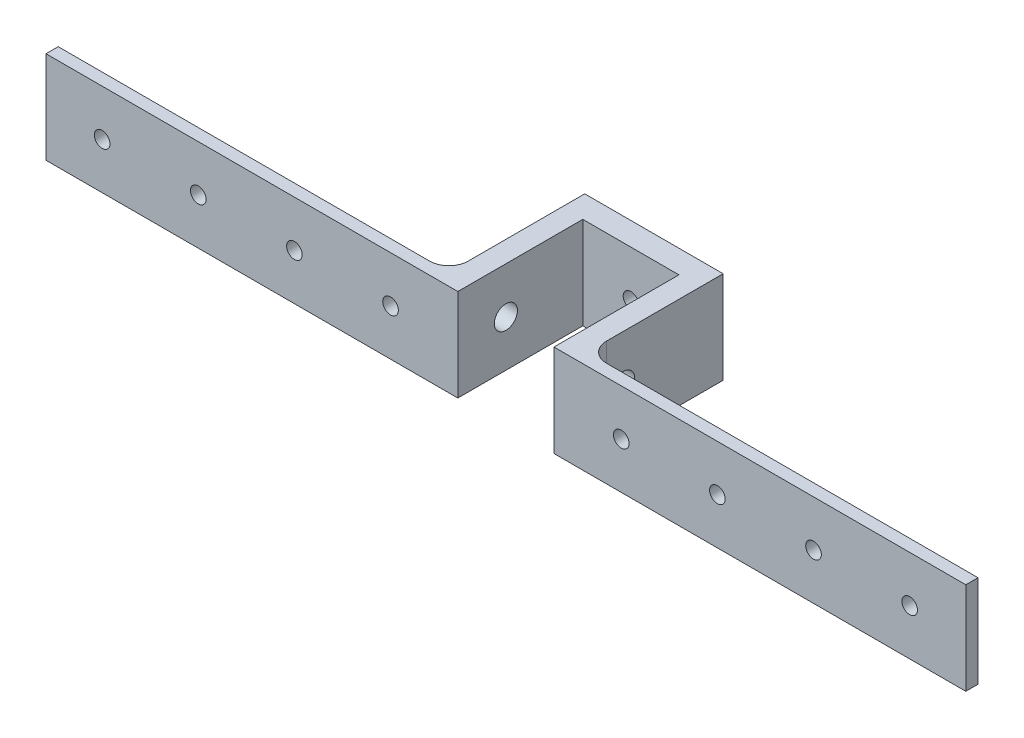
ISO-10303-21;
HEADER;
FILE_DESCRIPTION(('STEP AP214'),'2;1');
FILE_NAME('part.step','',(''),(''),'','','');
FILE_SCHEMA(('AUTOMOTIVE_DESIGN { 1 0 10303 214 1 1 1 1 }'));
ENDSEC;
DATA;
#1=APPLICATION_CONTEXT('core data for automotive mechanical design processes');
#2=APPLICATION_PROTOCOL_DEFINITION('international standard','automotive_design',2000,#1);
#3=PRODUCT_CONTEXT('',#1,'mechanical');
#4=PRODUCT('Part','Part','',(#3));
#5=PRODUCT_RELATED_PRODUCT_CATEGORY('part','',(#4));
#6=PRODUCT_DEFINITION_FORMATION('','',#4);
#7=PRODUCT_DEFINITION_CONTEXT('part definition',#1,'design');
#8=PRODUCT_DEFINITION('design','',#6,#7);
#9=PRODUCT_DEFINITION_SHAPE('','',#8);
#10=(LENGTH_UNIT() NAMED_UNIT(*) SI_UNIT(.MILLI.,.METRE.));
#11=(NAMED_UNIT(*) PLANE_ANGLE_UNIT() SI_UNIT($,.RADIAN.));
#12=(NAMED_UNIT(*) SI_UNIT($,.STERADIAN.) SOLID_ANGLE_UNIT());
#13=UNCERTAINTY_MEASURE_WITH_UNIT(LENGTH_MEASURE(1.E-05),#10,'distance_accuracy_value','');
#14=(GEOMETRIC_REPRESENTATION_CONTEXT(3) GLOBAL_UNCERTAINTY_ASSIGNED_CONTEXT((#13)) GLOBAL_UNIT_ASSIGNED_CONTEXT((#10,
#11,#12)) REPRESENTATION_CONTEXT('',''));
#15=CARTESIAN_POINT('',(0.,0.,0.));
#16=DIRECTION('',(0.,0.,1.));
#17=DIRECTION('',(1.,0.,0.));
#18=AXIS2_PLACEMENT_3D('',#15,#16,#17);
#19=CARTESIAN_POINT('',(12.5,24.,0.));
#20=DIRECTION('',(-1.,0.,0.));
#21=DIRECTION('',(0.,0.,1.));
#22=AXIS2_PLACEMENT_3D('',#19,#20,#21);
#23=PLANE('',#22);
#24=CARTESIAN_POINT('',(12.5,12.,3.63403614457834));
#25=DIRECTION('',(-1.,0.,0.));
#26=DIRECTION('',(0.,0.,1.));
#27=AXIS2_PLACEMENT_3D('',#24,#25,#26);
#28=CIRCLE('',#27,3.);
#29=CARTESIAN_POINT('',(12.5,12.,6.63403614457834));
#30=VERTEX_POINT('',#29);
#31=EDGE_CURVE('E220',#30,#30,#28,.T.);
#32=ORIENTED_EDGE('',*,*,#31,.F.);
#33=EDGE_LOOP('',(#32));
#34=FACE_BOUND('',#33,.T.);
#35=DIRECTION('',(0.,0.,-1.));
#36=VECTOR('',#35,1.);
#37=CARTESIAN_POINT('',(12.5,0.,0.));
#38=LINE('',#37,#36);
#39=CARTESIAN_POINT('',(12.5,0.,16.1340361445783));
#40=VERTEX_POINT('',#39);
#41=CARTESIAN_POINT('',(12.5,0.,-16.3659638554217));
#42=VERTEX_POINT('',#41);
#43=EDGE_CURVE('E150',#40,#42,#38,.T.);
#44=ORIENTED_EDGE('',*,*,#43,.F.);
#45=DIRECTION('',(0.,-1.,0.));
#46=VECTOR('',#45,1.);
#47=CARTESIAN_POINT('',(12.5,24.,16.1340361445783));
#48=LINE('',#47,#46);
#49=CARTESIAN_POINT('',(12.5,24.,16.1340361445783));
#50=VERTEX_POINT('',#49);
#51=EDGE_CURVE('E145',#50,#40,#48,.T.);
#52=ORIENTED_EDGE('',*,*,#51,.F.);
#53=DIRECTION('',(0.,0.,-1.));
#54=VECTOR('',#53,1.);
#55=CARTESIAN_POINT('',(12.5,24.,0.));
#56=LINE('',#55,#54);
#57=CARTESIAN_POINT('',(12.5,24.,-16.3659638554217));
#58=VERTEX_POINT('',#57);
#59=EDGE_CURVE('E227',#50,#58,#56,.T.);
#60=ORIENTED_EDGE('',*,*,#59,.T.);
#61=DIRECTION('',(0.,-1.,0.));
#62=VECTOR('',#61,1.);
#63=CARTESIAN_POINT('',(12.5,24.,-16.3659638554217));
#64=LINE('',#63,#62);
#65=EDGE_CURVE('E247',#58,#42,#64,.T.);
#66=ORIENTED_EDGE('',*,*,#65,.T.);
#67=EDGE_LOOP('',(#44,#52,#60,#66));
#68=FACE_BOUND('',#67,.T.);
#69=ADVANCED_FACE('F40',(#34,#68),#23,.T.);
#70=CARTESIAN_POINT('',(0.,24.,16.1340361445783));
#71=DIRECTION('',(0.,0.,-1.));
#72=DIRECTION('',(-1.,0.,0.));
#73=AXIS2_PLACEMENT_3D('',#70,#71,#72);
#74=PLANE('',#73);
#75=CARTESIAN_POINT('',(30.,12.,16.1340361445783));
#76=DIRECTION('',(0.,0.,1.));
#77=DIRECTION('',(1.,0.,0.));
#78=AXIS2_PLACEMENT_3D('',#75,#76,#77);
#79=CIRCLE('',#78,2.032);
#80=CARTESIAN_POINT('',(32.032,12.,16.1340361445783));
#81=VERTEX_POINT('',#80);
#82=EDGE_CURVE('E160',#81,#81,#79,.T.);
#83=ORIENTED_EDGE('',*,*,#82,.F.);
#84=EDGE_LOOP('',(#83));
#85=FACE_BOUND('',#84,.T.);
#86=CARTESIAN_POINT('',(55.,12.,16.1340361445783));
#87=DIRECTION('',(0.,0.,1.));
#88=DIRECTION('',(1.,0.,0.));
#89=AXIS2_PLACEMENT_3D('',#86,#87,#88);
#90=CIRCLE('',#89,2.032);
#91=CARTESIAN_POINT('',(57.032,12.,16.1340361445783));
#92=VERTEX_POINT('',#91);
#93=EDGE_CURVE('E414',#92,#92,#90,.T.);
#94=ORIENTED_EDGE('',*,*,#93,.F.);
#95=EDGE_LOOP('',(#94));
#96=FACE_BOUND('',#95,.T.);
#97=CARTESIAN_POINT('',(80.,12.,16.1340361445783));
#98=DIRECTION('',(0.,0.,1.));
#99=DIRECTION('',(1.,0.,0.));
#100=AXIS2_PLACEMENT_3D('',#97,#98,#99);
#101=CIRCLE('',#100,2.03200000000001);
#102=CARTESIAN_POINT('',(82.032,12.,16.1340361445783));
#103=VERTEX_POINT('',#102);
#104=EDGE_CURVE('E423',#103,#103,#101,.T.);
#105=ORIENTED_EDGE('',*,*,#104,.F.);
#106=EDGE_LOOP('',(#105));
#107=FACE_BOUND('',#106,.T.);
#108=CARTESIAN_POINT('',(105.,12.,16.1340361445783));
#109=DIRECTION('',(0.,0.,1.));
#110=DIRECTION('',(1.,0.,0.));
#111=AXIS2_PLACEMENT_3D('',#108,#109,#110);
#112=CIRCLE('',#111,2.03200000000001);
#113=CARTESIAN_POINT('',(107.032,12.,16.1340361445783));
#114=VERTEX_POINT('',#113);
#115=EDGE_CURVE('E429',#114,#114,#112,.T.);
#116=ORIENTED_EDGE('',*,*,#115,.F.);
#117=EDGE_LOOP('',(#116));
#118=FACE_BOUND('',#117,.T.);
#119=DIRECTION('',(1.,0.,0.));
#120=VECTOR('',#119,1.);
#121=CARTESIAN_POINT('',(0.,0.,16.1340361445783));
#122=LINE('',#121,#120);
#123=CARTESIAN_POINT('',(119.6,0.,16.1340361445783));
#124=VERTEX_POINT('',#123);
#125=EDGE_CURVE('E139',#40,#124,#122,.T.);
#126=ORIENTED_EDGE('',*,*,#125,.T.);
#127=DIRECTION('',(0.,1.,0.));
#128=VECTOR('',#127,1.);
#129=CARTESIAN_POINT('',(119.6,0.,16.1340361445783));
#130=LINE('',#129,#128);
#131=CARTESIAN_POINT('',(119.6,24.,16.1340361445783));
#132=VERTEX_POINT('',#131);
#133=EDGE_CURVE('E143',#124,#132,#130,.T.);
#134=ORIENTED_EDGE('',*,*,#133,.T.);
#135=DIRECTION('',(1.,0.,0.));
#136=VECTOR('',#135,1.);
#137=CARTESIAN_POINT('',(0.,24.,16.1340361445783));
#138=LINE('',#137,#136);
#139=EDGE_CURVE('E230',#50,#132,#138,.T.);
#140=ORIENTED_EDGE('',*,*,#139,.F.);
#141=ORIENTED_EDGE('',*,*,#51,.T.);
#142=EDGE_LOOP('',(#126,#134,#140,#141));
#143=FACE_BOUND('',#142,.T.);
#144=ADVANCED_FACE('F141',(#85,#96,#107,#118,#143),#74,.F.);
#145=CARTESIAN_POINT('',(18.,24.,0.));
#146=DIRECTION('',(-1.,0.,0.));
#147=DIRECTION('',(0.,0.,1.));
#148=AXIS2_PLACEMENT_3D('',#145,#146,#147);
#149=PLANE('',#148);
#150=CARTESIAN_POINT('',(18.,12.,3.63403614457834));
#151=DIRECTION('',(-1.,0.,0.));
#152=DIRECTION('',(0.,0.,1.));
#153=AXIS2_PLACEMENT_3D('',#150,#151,#152);
#154=CIRCLE('',#153,3.);
#155=CARTESIAN_POINT('',(18.,12.,6.63403614457834));
#156=VERTEX_POINT('',#155);
#157=EDGE_CURVE('E213',#156,#156,#154,.T.);
#158=ORIENTED_EDGE('',*,*,#157,.T.);
#159=EDGE_LOOP('',(#158));
#160=FACE_BOUND('',#159,.T.);
#161=DIRECTION('',(0.,0.,-1.));
#162=VECTOR('',#161,1.);
#163=CARTESIAN_POINT('',(18.,24.,0.));
#164=LINE('',#163,#162);
#165=CARTESIAN_POINT('',(18.,24.,7.95903614457834));
#166=VERTEX_POINT('',#165);
#167=CARTESIAN_POINT('',(18.,24.,-22.3659638554217));
#168=VERTEX_POINT('',#167);
#169=EDGE_CURVE('E233',#166,#168,#164,.T.);
#170=ORIENTED_EDGE('',*,*,#169,.F.);
#171=DIRECTION('',(0.,-1.,0.));
#172=VECTOR('',#171,1.);
#173=CARTESIAN_POINT('',(18.,24.,7.95903614457834));
#174=LINE('',#173,#172);
#175=CARTESIAN_POINT('',(18.,0.,7.95903614457834));
#176=VERTEX_POINT('',#175);
#177=EDGE_CURVE('E288',#166,#176,#174,.T.);
#178=ORIENTED_EDGE('',*,*,#177,.T.);
#179=DIRECTION('',(0.,0.,-1.));
#180=VECTOR('',#179,1.);
#181=CARTESIAN_POINT('',(18.,0.,0.));
#182=LINE('',#181,#180);
#183=CARTESIAN_POINT('',(18.,0.,-22.3659638554217));
#184=VERTEX_POINT('',#183);
#185=EDGE_CURVE('E149',#176,#184,#182,.T.);
#186=ORIENTED_EDGE('',*,*,#185,.T.);
#187=DIRECTION('',(0.,-1.,0.));
#188=VECTOR('',#187,1.);
#189=CARTESIAN_POINT('',(18.,24.,-22.3659638554217));
#190=LINE('',#189,#188);
#191=EDGE_CURVE('E271',#168,#184,#190,.T.);
#192=ORIENTED_EDGE('',*,*,#191,.F.);
#193=EDGE_LOOP('',(#170,#178,#186,#192));
#194=FACE_BOUND('',#193,.T.);
#195=ADVANCED_FACE('F294',(#160,#194),#149,.F.);
#196=CARTESIAN_POINT('',(0.,24.,-22.3659638554217));
#197=DIRECTION('',(0.,0.,1.));
#198=DIRECTION('',(1.,0.,0.));
#199=AXIS2_PLACEMENT_3D('',#196,#197,#198);
#200=PLANE('',#199);
#201=CARTESIAN_POINT('',(0.,12.,-22.3659638554217));
#202=DIRECTION('',(0.,0.,-1.));
#203=DIRECTION('',(-1.,0.,0.));
#204=AXIS2_PLACEMENT_3D('',#201,#202,#203);
#205=CIRCLE('',#204,2.);
#206=CARTESIAN_POINT('',(-2.00000000000001,12.,-22.3659638554217));
#207=VERTEX_POINT('',#206);
#208=EDGE_CURVE('E223',#207,#207,#205,.T.);
#209=ORIENTED_EDGE('',*,*,#208,.F.);
#210=EDGE_LOOP('',(#209));
#211=FACE_BOUND('',#210,.T.);
#212=DIRECTION('',(-1.,0.,0.));
#213=VECTOR('',#212,1.);
#214=CARTESIAN_POINT('',(0.,0.,-22.3659638554217));
#215=LINE('',#214,#213);
#216=CARTESIAN_POINT('',(-18.,0.,-22.3659638554217));
#217=VERTEX_POINT('',#216);
#218=EDGE_CURVE('E250',#184,#217,#215,.T.);
#219=ORIENTED_EDGE('',*,*,#218,.T.);
#220=DIRECTION('',(0.,-1.,0.));
#221=VECTOR('',#220,1.);
#222=CARTESIAN_POINT('',(-18.,24.,-22.3659638554217));
#223=LINE('',#222,#221);
#224=CARTESIAN_POINT('',(-18.,24.,-22.3659638554217));
#225=VERTEX_POINT('',#224);
#226=EDGE_CURVE('E268',#225,#217,#223,.T.);
#227=ORIENTED_EDGE('',*,*,#226,.F.);
#228=DIRECTION('',(-1.,0.,0.));
#229=VECTOR('',#228,1.);
#230=CARTESIAN_POINT('',(0.,24.,-22.3659638554217));
#231=LINE('',#230,#229);
#232=EDGE_CURVE('E235',#168,#225,#231,.T.);
#233=ORIENTED_EDGE('',*,*,#232,.F.);
#234=ORIENTED_EDGE('',*,*,#191,.T.);
#235=EDGE_LOOP('',(#219,#227,#233,#234));
#236=FACE_BOUND('',#235,.T.);
#237=ADVANCED_FACE('F302',(#211,#236),#200,.F.);
#238=CARTESIAN_POINT('',(-18.,24.,0.));
#239=DIRECTION('',(-1.,0.,0.));
#240=DIRECTION('',(0.,0.,1.));
#241=AXIS2_PLACEMENT_3D('',#238,#239,#240);
#242=PLANE('',#241);
#243=DIRECTION('',(0.,0.,-1.));
#244=VECTOR('',#243,1.);
#245=CARTESIAN_POINT('',(-18.,0.,0.));
#246=LINE('',#245,#244);
#247=CARTESIAN_POINT('',(-18.,0.,7.95903614457834));
#248=VERTEX_POINT('',#247);
#249=EDGE_CURVE('E253',#248,#217,#246,.T.);
#250=ORIENTED_EDGE('',*,*,#249,.F.);
#251=DIRECTION('',(0.,-1.,0.));
#252=VECTOR('',#251,1.);
#253=CARTESIAN_POINT('',(-18.,24.,7.95903614457834));
#254=LINE('',#253,#252);
#255=CARTESIAN_POINT('',(-18.,24.,7.95903614457834));
#256=VERTEX_POINT('',#255);
#257=EDGE_CURVE('E282',#248,#256,#254,.F.);
#258=ORIENTED_EDGE('',*,*,#257,.T.);
#259=DIRECTION('',(0.,0.,-1.));
#260=VECTOR('',#259,1.);
#261=CARTESIAN_POINT('',(-18.,24.,0.));
#262=LINE('',#261,#260);
#263=EDGE_CURVE('E238',#256,#225,#262,.T.);
#264=ORIENTED_EDGE('',*,*,#263,.T.);
#265=ORIENTED_EDGE('',*,*,#226,.T.);
#266=EDGE_LOOP('',(#250,#258,#264,#265));
#267=FACE_BOUND('',#266,.T.);
#268=CARTESIAN_POINT('',(-18.,12.,3.63403614457834));
#269=DIRECTION('',(-1.,0.,0.));
#270=DIRECTION('',(0.,0.,1.));
#271=AXIS2_PLACEMENT_3D('',#268,#269,#270);
#272=CIRCLE('',#271,3.);
#273=CARTESIAN_POINT('',(-18.,12.,6.63403614457834));
#274=VERTEX_POINT('',#273);
#275=EDGE_CURVE('E217',#274,#274,#272,.T.);
#276=ORIENTED_EDGE('',*,*,#275,.F.);
#277=EDGE_LOOP('',(#276));
#278=FACE_BOUND('',#277,.T.);
#279=ADVANCED_FACE('F332',(#267,#278),#242,.T.);
#280=CARTESIAN_POINT('',(0.,24.,16.1340361445783));
#281=DIRECTION('',(0.,0.,-1.));
#282=DIRECTION('',(-1.,0.,0.));
#283=AXIS2_PLACEMENT_3D('',#280,#281,#282);
#284=PLANE('',#283);
#285=CARTESIAN_POINT('',(-30.,12.,16.1340361445783));
#286=DIRECTION('',(0.,0.,-1.));
#287=DIRECTION('',(-1.,0.,0.));
#288=AXIS2_PLACEMENT_3D('',#285,#286,#287);
#289=CIRCLE('',#288,2.032);
#290=CARTESIAN_POINT('',(-32.032,12.,16.1340361445783));
#291=VERTEX_POINT('',#290);
#292=EDGE_CURVE('E174',#291,#291,#289,.T.);
#293=ORIENTED_EDGE('',*,*,#292,.T.);
#294=EDGE_LOOP('',(#293));
#295=FACE_BOUND('',#294,.T.);
#296=CARTESIAN_POINT('',(-55.,12.,16.1340361445783));
#297=DIRECTION('',(0.,0.,-1.));
#298=DIRECTION('',(-1.,0.,0.));
#299=AXIS2_PLACEMENT_3D('',#296,#297,#298);
#300=CIRCLE('',#299,2.032);
#301=CARTESIAN_POINT('',(-57.032,12.,16.1340361445783));
#302=VERTEX_POINT('',#301);
#303=EDGE_CURVE('E181',#302,#302,#300,.T.);
#304=ORIENTED_EDGE('',*,*,#303,.T.);
#305=EDGE_LOOP('',(#304));
#306=FACE_BOUND('',#305,.T.);
#307=CARTESIAN_POINT('',(-80.,12.,16.1340361445783));
#308=DIRECTION('',(0.,0.,-1.));
#309=DIRECTION('',(-1.,0.,0.));
#310=AXIS2_PLACEMENT_3D('',#307,#308,#309);
#311=CIRCLE('',#310,2.03200000000001);
#312=CARTESIAN_POINT('',(-82.032,12.,16.1340361445783));
#313=VERTEX_POINT('',#312);
#314=EDGE_CURVE('E187',#313,#313,#311,.T.);
#315=ORIENTED_EDGE('',*,*,#314,.T.);
#316=EDGE_LOOP('',(#315));
#317=FACE_BOUND('',#316,.T.);
#318=CARTESIAN_POINT('',(-105.,12.,16.1340361445783));
#319=DIRECTION('',(0.,0.,-1.));
#320=DIRECTION('',(-1.,0.,0.));
#321=AXIS2_PLACEMENT_3D('',#318,#319,#320);
#322=CIRCLE('',#321,2.03200000000001);
#323=CARTESIAN_POINT('',(-107.032,12.,16.1340361445783));
#324=VERTEX_POINT('',#323);
#325=EDGE_CURVE('E193',#324,#324,#322,.T.);
#326=ORIENTED_EDGE('',*,*,#325,.T.);
#327=EDGE_LOOP('',(#326));
#328=FACE_BOUND('',#327,.T.);
#329=DIRECTION('',(1.,0.,0.));
#330=VECTOR('',#329,1.);
#331=CARTESIAN_POINT('',(0.,0.,16.1340361445783));
#332=LINE('',#331,#330);
#333=CARTESIAN_POINT('',(-119.6,0.,16.1340361445783));
#334=VERTEX_POINT('',#333);
#335=CARTESIAN_POINT('',(-12.5,0.,16.1340361445783));
#336=VERTEX_POINT('',#335);
#337=EDGE_CURVE('E255',#334,#336,#332,.T.);
#338=ORIENTED_EDGE('',*,*,#337,.T.);
#339=DIRECTION('',(0.,-1.,0.));
#340=VECTOR('',#339,1.);
#341=CARTESIAN_POINT('',(-12.5,24.,16.1340361445783));
#342=LINE('',#341,#340);
#343=CARTESIAN_POINT('',(-12.5,24.,16.1340361445783));
#344=VERTEX_POINT('',#343);
#345=EDGE_CURVE('E265',#344,#336,#342,.T.);
#346=ORIENTED_EDGE('',*,*,#345,.F.);
#347=DIRECTION('',(1.,0.,0.));
#348=VECTOR('',#347,1.);
#349=CARTESIAN_POINT('',(0.,24.,16.1340361445783));
#350=LINE('',#349,#348);
#351=CARTESIAN_POINT('',(-119.6,24.,16.1340361445783));
#352=VERTEX_POINT('',#351);
#353=EDGE_CURVE('E240',#352,#344,#350,.T.);
#354=ORIENTED_EDGE('',*,*,#353,.F.);
#355=DIRECTION('',(0.,1.,0.));
#356=VECTOR('',#355,1.);
#357=CARTESIAN_POINT('',(-119.6,0.,16.1340361445783));
#358=LINE('',#357,#356);
#359=EDGE_CURVE('E177',#334,#352,#358,.T.);
#360=ORIENTED_EDGE('',*,*,#359,.F.);
#361=EDGE_LOOP('',(#338,#346,#354,#360));
#362=FACE_BOUND('',#361,.T.);
#363=ADVANCED_FACE('F336',(#295,#306,#317,#328,#362),#284,.F.);
#364=CARTESIAN_POINT('',(-12.5,24.,0.));
#365=DIRECTION('',(-1.,0.,0.));
#366=DIRECTION('',(0.,0.,1.));
#367=AXIS2_PLACEMENT_3D('',#364,#365,#366);
#368=PLANE('',#367);
#369=CARTESIAN_POINT('',(-12.5,12.,3.63403614457834));
#370=DIRECTION('',(-1.,0.,0.));
#371=DIRECTION('',(0.,0.,1.));
#372=AXIS2_PLACEMENT_3D('',#369,#370,#371);
#373=CIRCLE('',#372,3.);
#374=CARTESIAN_POINT('',(-12.5,12.,6.63403614457834));
#375=VERTEX_POINT('',#374);
#376=EDGE_CURVE('E216',#375,#375,#373,.T.);
#377=ORIENTED_EDGE('',*,*,#376,.T.);
#378=EDGE_LOOP('',(#377));
#379=FACE_BOUND('',#378,.T.);
#380=DIRECTION('',(0.,0.,-1.));
#381=VECTOR('',#380,1.);
#382=CARTESIAN_POINT('',(-12.5,0.,0.));
#383=LINE('',#382,#381);
#384=CARTESIAN_POINT('',(-12.5,0.,-16.3659638554217));
#385=VERTEX_POINT('',#384);
#386=EDGE_CURVE('E257',#336,#385,#383,.T.);
#387=ORIENTED_EDGE('',*,*,#386,.T.);
#388=DIRECTION('',(0.,-1.,0.));
#389=VECTOR('',#388,1.);
#390=CARTESIAN_POINT('',(-12.5,24.,-16.3659638554217));
#391=LINE('',#390,#389);
#392=CARTESIAN_POINT('',(-12.5,24.,-16.3659638554217));
#393=VERTEX_POINT('',#392);
#394=EDGE_CURVE('E263',#393,#385,#391,.T.);
#395=ORIENTED_EDGE('',*,*,#394,.F.);
#396=DIRECTION('',(0.,0.,-1.));
#397=VECTOR('',#396,1.);
#398=CARTESIAN_POINT('',(-12.5,24.,0.));
#399=LINE('',#398,#397);
#400=EDGE_CURVE('E242',#344,#393,#399,.T.);
#401=ORIENTED_EDGE('',*,*,#400,.F.);
#402=ORIENTED_EDGE('',*,*,#345,.T.);
#403=EDGE_LOOP('',(#387,#395,#401,#402));
#404=FACE_BOUND('',#403,.T.);
#405=ADVANCED_FACE('F340',(#379,#404),#368,.F.);
#406=CARTESIAN_POINT('',(0.,24.,-16.3659638554217));
#407=DIRECTION('',(0.,0.,1.));
#408=DIRECTION('',(1.,0.,0.));
#409=AXIS2_PLACEMENT_3D('',#406,#407,#408);
#410=PLANE('',#409);
#411=CARTESIAN_POINT('',(0.,12.,-16.3659638554217));
#412=DIRECTION('',(0.,0.,1.));
#413=DIRECTION('',(1.,0.,0.));
#414=AXIS2_PLACEMENT_3D('',#411,#412,#413);
#415=CIRCLE('',#414,2.);
#416=CARTESIAN_POINT('',(1.99999999999999,12.,-16.3659638554217));
#417=VERTEX_POINT('',#416);
#418=EDGE_CURVE('E226',#417,#417,#415,.T.);
#419=ORIENTED_EDGE('',*,*,#418,.F.);
#420=EDGE_LOOP('',(#419));
#421=FACE_BOUND('',#420,.T.);
#422=DIRECTION('',(-1.,0.,0.));
#423=VECTOR('',#422,1.);
#424=CARTESIAN_POINT('',(0.,0.,-16.3659638554217));
#425=LINE('',#424,#423);
#426=EDGE_CURVE('E231',#42,#385,#425,.T.);
#427=ORIENTED_EDGE('',*,*,#426,.F.);
#428=ORIENTED_EDGE('',*,*,#65,.F.);
#429=DIRECTION('',(-1.,0.,0.));
#430=VECTOR('',#429,1.);
#431=CARTESIAN_POINT('',(0.,24.,-16.3659638554217));
#432=LINE('',#431,#430);
#433=EDGE_CURVE('E244',#58,#393,#432,.T.);
#434=ORIENTED_EDGE('',*,*,#433,.T.);
#435=ORIENTED_EDGE('',*,*,#394,.T.);
#436=EDGE_LOOP('',(#427,#428,#434,#435));
#437=FACE_BOUND('',#436,.T.);
#438=ADVANCED_FACE('F344',(#421,#437),#410,.T.);
#439=CARTESIAN_POINT('',(0.,24.,0.));
#440=DIRECTION('',(0.,1.,0.));
#441=DIRECTION('',(0.,0.,1.));
#442=AXIS2_PLACEMENT_3D('',#439,#440,#441);
#443=PLANE('',#442);
#444=ORIENTED_EDGE('',*,*,#59,.F.);
#445=ORIENTED_EDGE('',*,*,#139,.T.);
#446=DIRECTION('',(0.,0.,-1.));
#447=VECTOR('',#446,1.);
#448=CARTESIAN_POINT('',(119.6,24.,16.1340361445783));
#449=LINE('',#448,#447);
#450=CARTESIAN_POINT('',(119.6,24.,12.9590361445783));
#451=VERTEX_POINT('',#450);
#452=EDGE_CURVE('E159',#132,#451,#449,.T.);
#453=ORIENTED_EDGE('',*,*,#452,.T.);
#454=DIRECTION('',(-1.,0.,0.));
#455=VECTOR('',#454,1.);
#456=CARTESIAN_POINT('',(119.6,24.,12.9590361445783));
#457=LINE('',#456,#455);
#458=CARTESIAN_POINT('',(23.,24.,12.9590361445783));
#459=VERTEX_POINT('',#458);
#460=EDGE_CURVE('E170',#451,#459,#457,.T.);
#461=ORIENTED_EDGE('',*,*,#460,.T.);
#462=CARTESIAN_POINT('',(23.,24.,7.95903614457834));
#463=DIRECTION('',(0.,1.,0.));
#464=DIRECTION('',(0.,0.,1.));
#465=AXIS2_PLACEMENT_3D('',#462,#463,#464);
#466=CIRCLE('',#465,5.);
#467=EDGE_CURVE('E11',#459,#166,#466,.F.);
#468=ORIENTED_EDGE('',*,*,#467,.T.);
#469=ORIENTED_EDGE('',*,*,#169,.T.);
#470=ORIENTED_EDGE('',*,*,#232,.T.);
#471=ORIENTED_EDGE('',*,*,#263,.F.);
#472=CARTESIAN_POINT('',(-23.,24.,7.95903614457834));
#473=DIRECTION('',(0.,1.,0.));
#474=DIRECTION('',(0.,0.,1.));
#475=AXIS2_PLACEMENT_3D('',#472,#473,#474);
#476=CIRCLE('',#475,5.);
#477=CARTESIAN_POINT('',(-23.,24.,12.9590361445783));
#478=VERTEX_POINT('',#477);
#479=EDGE_CURVE('E286',#256,#478,#476,.F.);
#480=ORIENTED_EDGE('',*,*,#479,.T.);
#481=DIRECTION('',(1.,0.,0.));
#482=VECTOR('',#481,1.);
#483=CARTESIAN_POINT('',(-119.6,24.,12.9590361445783));
#484=LINE('',#483,#482);
#485=CARTESIAN_POINT('',(-119.6,24.,12.9590361445783));
#486=VERTEX_POINT('',#485);
#487=EDGE_CURVE('E210',#486,#478,#484,.T.);
#488=ORIENTED_EDGE('',*,*,#487,.F.);
#489=DIRECTION('',(0.,0.,-1.));
#490=VECTOR('',#489,1.);
#491=CARTESIAN_POINT('',(-119.6,24.,16.1340361445783));
#492=LINE('',#491,#490);
#493=EDGE_CURVE('E200',#352,#486,#492,.T.);
#494=ORIENTED_EDGE('',*,*,#493,.F.);
#495=ORIENTED_EDGE('',*,*,#353,.T.);
#496=ORIENTED_EDGE('',*,*,#400,.T.);
#497=ORIENTED_EDGE('',*,*,#433,.F.);
#498=EDGE_LOOP('',(#444,#445,#453,#461,#468,#469,#470,#471,#480,#488,#494,#495,#496,#497));
#499=FACE_BOUND('',#498,.T.);
#500=ADVANCED_FACE('F307',(#499),#443,.T.);
#501=CARTESIAN_POINT('',(0.,0.,0.));
#502=DIRECTION('',(0.,1.,0.));
#503=DIRECTION('',(0.,0.,1.));
#504=AXIS2_PLACEMENT_3D('',#501,#502,#503);
#505=PLANE('',#504);
#506=ORIENTED_EDGE('',*,*,#43,.T.);
#507=ORIENTED_EDGE('',*,*,#426,.T.);
#508=ORIENTED_EDGE('',*,*,#386,.F.);
#509=ORIENTED_EDGE('',*,*,#337,.F.);
#510=DIRECTION('',(0.,0.,1.));
#511=VECTOR('',#510,1.);
#512=CARTESIAN_POINT('',(-119.6,0.,16.1340361445783));
#513=LINE('',#512,#511);
#514=CARTESIAN_POINT('',(-119.6,0.,12.9590361445783));
#515=VERTEX_POINT('',#514);
#516=EDGE_CURVE('E204',#515,#334,#513,.T.);
#517=ORIENTED_EDGE('',*,*,#516,.F.);
#518=DIRECTION('',(1.,0.,0.));
#519=VECTOR('',#518,1.);
#520=CARTESIAN_POINT('',(-119.6,0.,12.9590361445783));
#521=LINE('',#520,#519);
#522=CARTESIAN_POINT('',(-23.,0.,12.9590361445783));
#523=VERTEX_POINT('',#522);
#524=EDGE_CURVE('E207',#515,#523,#521,.T.);
#525=ORIENTED_EDGE('',*,*,#524,.T.);
#526=CARTESIAN_POINT('',(-23.,0.,7.95903614457834));
#527=DIRECTION('',(0.,1.,0.));
#528=DIRECTION('',(0.,0.,1.));
#529=AXIS2_PLACEMENT_3D('',#526,#527,#528);
#530=CIRCLE('',#529,5.);
#531=EDGE_CURVE('E284',#523,#248,#530,.T.);
#532=ORIENTED_EDGE('',*,*,#531,.T.);
#533=ORIENTED_EDGE('',*,*,#249,.T.);
#534=ORIENTED_EDGE('',*,*,#218,.F.);
#535=ORIENTED_EDGE('',*,*,#185,.F.);
#536=CARTESIAN_POINT('',(23.,0.,7.95903614457834));
#537=DIRECTION('',(0.,1.,0.));
#538=DIRECTION('',(0.,0.,1.));
#539=AXIS2_PLACEMENT_3D('',#536,#537,#538);
#540=CIRCLE('',#539,5.);
#541=CARTESIAN_POINT('',(23.,0.,12.9590361445783));
#542=VERTEX_POINT('',#541);
#543=EDGE_CURVE('E48',#176,#542,#540,.T.);
#544=ORIENTED_EDGE('',*,*,#543,.T.);
#545=DIRECTION('',(-1.,0.,0.));
#546=VECTOR('',#545,1.);
#547=CARTESIAN_POINT('',(119.6,0.,12.9590361445783));
#548=LINE('',#547,#546);
#549=CARTESIAN_POINT('',(119.6,0.,12.9590361445783));
#550=VERTEX_POINT('',#549);
#551=EDGE_CURVE('E163',#550,#542,#548,.T.);
#552=ORIENTED_EDGE('',*,*,#551,.F.);
#553=DIRECTION('',(0.,0.,1.));
#554=VECTOR('',#553,1.);
#555=CARTESIAN_POINT('',(119.6,0.,16.1340361445783));
#556=LINE('',#555,#554);
#557=EDGE_CURVE('E156',#550,#124,#556,.T.);
#558=ORIENTED_EDGE('',*,*,#557,.T.);
#559=ORIENTED_EDGE('',*,*,#125,.F.);
#560=EDGE_LOOP('',(#506,#507,#508,#509,#517,#525,#532,#533,#534,#535,#544,#552,#558,#559));
#561=FACE_BOUND('',#560,.T.);
#562=ADVANCED_FACE('F162',(#561),#505,.F.);
#563=CARTESIAN_POINT('',(0.,12.,1.63403614457833));
#564=DIRECTION('',(0.,0.,-1.));
#565=DIRECTION('',(-1.,0.,0.));
#566=AXIS2_PLACEMENT_3D('',#563,#564,#565);
#567=CYLINDRICAL_SURFACE('',#566,2.);
#568=ORIENTED_EDGE('',*,*,#418,.T.);
#569=EDGE_LOOP('',(#568));
#570=FACE_BOUND('',#569,.T.);
#571=ORIENTED_EDGE('',*,*,#208,.T.);
#572=EDGE_LOOP('',(#571));
#573=FACE_BOUND('',#572,.T.);
#574=ADVANCED_FACE('F351',(#570,#573),#567,.F.);
#575=CARTESIAN_POINT('',(18.,12.,3.63403614457834));
#576=DIRECTION('',(-1.,0.,0.));
#577=DIRECTION('',(0.,0.,1.));
#578=AXIS2_PLACEMENT_3D('',#575,#576,#577);
#579=CYLINDRICAL_SURFACE('',#578,3.);
#580=ORIENTED_EDGE('',*,*,#275,.T.);
#581=EDGE_LOOP('',(#580));
#582=FACE_BOUND('',#581,.T.);
#583=ORIENTED_EDGE('',*,*,#376,.F.);
#584=EDGE_LOOP('',(#583));
#585=FACE_BOUND('',#584,.T.);
#586=ADVANCED_FACE('F356',(#582,#585),#579,.F.);
#587=ORIENTED_EDGE('',*,*,#31,.T.);
#588=EDGE_LOOP('',(#587));
#589=FACE_BOUND('',#588,.T.);
#590=ORIENTED_EDGE('',*,*,#157,.F.);
#591=EDGE_LOOP('',(#590));
#592=FACE_BOUND('',#591,.T.);
#593=ADVANCED_FACE('F358',(#589,#592),#579,.F.);
#594=CARTESIAN_POINT('',(-119.6,0.,12.9590361445783));
#595=DIRECTION('',(0.,0.,1.));
#596=DIRECTION('',(1.,0.,0.));
#597=AXIS2_PLACEMENT_3D('',#594,#595,#596);
#598=PLANE('',#597);
#599=CARTESIAN_POINT('',(-30.,12.,12.9590361445783));
#600=DIRECTION('',(0.,0.,-1.));
#601=DIRECTION('',(-1.,0.,0.));
#602=AXIS2_PLACEMENT_3D('',#599,#600,#601);
#603=CIRCLE('',#602,2.032);
#604=CARTESIAN_POINT('',(-32.032,12.,12.9590361445783));
#605=VERTEX_POINT('',#604);
#606=EDGE_CURVE('E178',#605,#605,#603,.T.);
#607=ORIENTED_EDGE('',*,*,#606,.F.);
#608=EDGE_LOOP('',(#607));
#609=FACE_BOUND('',#608,.T.);
#610=CARTESIAN_POINT('',(-55.,12.,12.9590361445783));
#611=DIRECTION('',(0.,0.,-1.));
#612=DIRECTION('',(-1.,0.,0.));
#613=AXIS2_PLACEMENT_3D('',#610,#611,#612);
#614=CIRCLE('',#613,2.032);
#615=CARTESIAN_POINT('',(-57.032,12.,12.9590361445783));
#616=VERTEX_POINT('',#615);
#617=EDGE_CURVE('E184',#616,#616,#614,.T.);
#618=ORIENTED_EDGE('',*,*,#617,.F.);
#619=EDGE_LOOP('',(#618));
#620=FACE_BOUND('',#619,.T.);
#621=CARTESIAN_POINT('',(-80.,12.,12.9590361445783));
#622=DIRECTION('',(0.,0.,-1.));
#623=DIRECTION('',(-1.,0.,0.));
#624=AXIS2_PLACEMENT_3D('',#621,#622,#623);
#625=CIRCLE('',#624,2.03200000000001);
#626=CARTESIAN_POINT('',(-82.032,12.,12.9590361445783));
#627=VERTEX_POINT('',#626);
#628=EDGE_CURVE('E190',#627,#627,#625,.T.);
#629=ORIENTED_EDGE('',*,*,#628,.F.);
#630=EDGE_LOOP('',(#629));
#631=FACE_BOUND('',#630,.T.);
#632=CARTESIAN_POINT('',(-105.,12.,12.9590361445783));
#633=DIRECTION('',(0.,0.,-1.));
#634=DIRECTION('',(-1.,0.,0.));
#635=AXIS2_PLACEMENT_3D('',#632,#633,#634);
#636=CIRCLE('',#635,2.03200000000001);
#637=CARTESIAN_POINT('',(-107.032,12.,12.9590361445783));
#638=VERTEX_POINT('',#637);
#639=EDGE_CURVE('E173',#638,#638,#636,.T.);
#640=ORIENTED_EDGE('',*,*,#639,.F.);
#641=EDGE_LOOP('',(#640));
#642=FACE_BOUND('',#641,.T.);
#643=ORIENTED_EDGE('',*,*,#487,.T.);
#644=DIRECTION('',(0.,-1.,0.));
#645=VECTOR('',#644,1.);
#646=CARTESIAN_POINT('',(-23.,0.,12.9590361445783));
#647=LINE('',#646,#645);
#648=EDGE_CURVE('E275',#478,#523,#647,.T.);
#649=ORIENTED_EDGE('',*,*,#648,.T.);
#650=ORIENTED_EDGE('',*,*,#524,.F.);
#651=DIRECTION('',(0.,-1.,0.));
#652=VECTOR('',#651,1.);
#653=CARTESIAN_POINT('',(-119.6,0.,12.9590361445783));
#654=LINE('',#653,#652);
#655=EDGE_CURVE('E202',#486,#515,#654,.T.);
#656=ORIENTED_EDGE('',*,*,#655,.F.);
#657=EDGE_LOOP('',(#643,#649,#650,#656));
#658=FACE_BOUND('',#657,.T.);
#659=ADVANCED_FACE('F361',(#609,#620,#631,#642,#658),#598,.F.);
#660=CARTESIAN_POINT('',(-119.6,0.,0.));
#661=DIRECTION('',(-1.,0.,0.));
#662=DIRECTION('',(0.,0.,1.));
#663=AXIS2_PLACEMENT_3D('',#660,#661,#662);
#664=PLANE('',#663);
#665=ORIENTED_EDGE('',*,*,#359,.T.);
#666=ORIENTED_EDGE('',*,*,#493,.T.);
#667=ORIENTED_EDGE('',*,*,#655,.T.);
#668=ORIENTED_EDGE('',*,*,#516,.T.);
#669=EDGE_LOOP('',(#665,#666,#667,#668));
#670=FACE_BOUND('',#669,.T.);
#671=ADVANCED_FACE('F365',(#670),#664,.T.);
#672=CARTESIAN_POINT('',(-105.,12.,16.1340361445783));
#673=DIRECTION('',(0.,0.,-1.));
#674=DIRECTION('',(-1.,0.,0.));
#675=AXIS2_PLACEMENT_3D('',#672,#673,#674);
#676=CYLINDRICAL_SURFACE('',#675,2.03200000000001);
#677=ORIENTED_EDGE('',*,*,#325,.F.);
#678=EDGE_LOOP('',(#677));
#679=FACE_BOUND('',#678,.T.);
#680=ORIENTED_EDGE('',*,*,#639,.T.);
#681=EDGE_LOOP('',(#680));
#682=FACE_BOUND('',#681,.T.);
#683=ADVANCED_FACE('F369',(#679,#682),#676,.F.);
#684=CARTESIAN_POINT('',(-80.,12.,16.1340361445783));
#685=DIRECTION('',(0.,0.,-1.));
#686=DIRECTION('',(-1.,0.,0.));
#687=AXIS2_PLACEMENT_3D('',#684,#685,#686);
#688=CYLINDRICAL_SURFACE('',#687,2.03200000000001);
#689=ORIENTED_EDGE('',*,*,#314,.F.);
#690=EDGE_LOOP('',(#689));
#691=FACE_BOUND('',#690,.T.);
#692=ORIENTED_EDGE('',*,*,#628,.T.);
#693=EDGE_LOOP('',(#692));
#694=FACE_BOUND('',#693,.T.);
#695=ADVANCED_FACE('F373',(#691,#694),#688,.F.);
#696=CARTESIAN_POINT('',(-55.,12.,16.1340361445783));
#697=DIRECTION('',(0.,0.,-1.));
#698=DIRECTION('',(-1.,0.,0.));
#699=AXIS2_PLACEMENT_3D('',#696,#697,#698);
#700=CYLINDRICAL_SURFACE('',#699,2.032);
#701=ORIENTED_EDGE('',*,*,#303,.F.);
#702=EDGE_LOOP('',(#701));
#703=FACE_BOUND('',#702,.T.);
#704=ORIENTED_EDGE('',*,*,#617,.T.);
#705=EDGE_LOOP('',(#704));
#706=FACE_BOUND('',#705,.T.);
#707=ADVANCED_FACE('F377',(#703,#706),#700,.F.);
#708=CARTESIAN_POINT('',(-30.,12.,16.1340361445783));
#709=DIRECTION('',(0.,0.,-1.));
#710=DIRECTION('',(-1.,0.,0.));
#711=AXIS2_PLACEMENT_3D('',#708,#709,#710);
#712=CYLINDRICAL_SURFACE('',#711,2.032);
#713=ORIENTED_EDGE('',*,*,#292,.F.);
#714=EDGE_LOOP('',(#713));
#715=FACE_BOUND('',#714,.T.);
#716=ORIENTED_EDGE('',*,*,#606,.T.);
#717=EDGE_LOOP('',(#716));
#718=FACE_BOUND('',#717,.T.);
#719=ADVANCED_FACE('F381',(#715,#718),#712,.F.);
#720=CARTESIAN_POINT('',(119.6,0.,12.9590361445783));
#721=DIRECTION('',(0.,0.,-1.));
#722=DIRECTION('',(-1.,0.,0.));
#723=AXIS2_PLACEMENT_3D('',#720,#721,#722);
#724=PLANE('',#723);
#725=CARTESIAN_POINT('',(30.,12.,12.9590361445783));
#726=DIRECTION('',(0.,0.,1.));
#727=DIRECTION('',(1.,0.,0.));
#728=AXIS2_PLACEMENT_3D('',#725,#726,#727);
#729=CIRCLE('',#728,2.032);
#730=CARTESIAN_POINT('',(32.032,12.,12.9590361445783));
#731=VERTEX_POINT('',#730);
#732=EDGE_CURVE('E413',#731,#731,#729,.T.);
#733=ORIENTED_EDGE('',*,*,#732,.T.);
#734=EDGE_LOOP('',(#733));
#735=FACE_BOUND('',#734,.T.);
#736=CARTESIAN_POINT('',(55.,12.,12.9590361445783));
#737=DIRECTION('',(0.,0.,1.));
#738=DIRECTION('',(1.,0.,0.));
#739=AXIS2_PLACEMENT_3D('',#736,#737,#738);
#740=CIRCLE('',#739,2.032);
#741=CARTESIAN_POINT('',(57.032,12.,12.9590361445783));
#742=VERTEX_POINT('',#741);
#743=EDGE_CURVE('E418',#742,#742,#740,.T.);
#744=ORIENTED_EDGE('',*,*,#743,.T.);
#745=EDGE_LOOP('',(#744));
#746=FACE_BOUND('',#745,.T.);
#747=CARTESIAN_POINT('',(80.,12.,12.9590361445783));
#748=DIRECTION('',(0.,0.,1.));
#749=DIRECTION('',(1.,0.,0.));
#750=AXIS2_PLACEMENT_3D('',#747,#748,#749);
#751=CIRCLE('',#750,2.03200000000001);
#752=CARTESIAN_POINT('',(82.032,12.,12.9590361445783));
#753=VERTEX_POINT('',#752);
#754=EDGE_CURVE('E426',#753,#753,#751,.T.);
#755=ORIENTED_EDGE('',*,*,#754,.T.);
#756=EDGE_LOOP('',(#755));
#757=FACE_BOUND('',#756,.T.);
#758=CARTESIAN_POINT('',(105.,12.,12.9590361445783));
#759=DIRECTION('',(0.,0.,1.));
#760=DIRECTION('',(1.,0.,0.));
#761=AXIS2_PLACEMENT_3D('',#758,#759,#760);
#762=CIRCLE('',#761,2.03200000000001);
#763=CARTESIAN_POINT('',(107.032,12.,12.9590361445783));
#764=VERTEX_POINT('',#763);
#765=EDGE_CURVE('E431',#764,#764,#762,.T.);
#766=ORIENTED_EDGE('',*,*,#765,.T.);
#767=EDGE_LOOP('',(#766));
#768=FACE_BOUND('',#767,.T.);
#769=ORIENTED_EDGE('',*,*,#551,.T.);
#770=DIRECTION('',(0.,-1.,0.));
#771=VECTOR('',#770,1.);
#772=CARTESIAN_POINT('',(23.,0.,12.9590361445783));
#773=LINE('',#772,#771);
#774=EDGE_CURVE('E61',#542,#459,#773,.F.);
#775=ORIENTED_EDGE('',*,*,#774,.T.);
#776=ORIENTED_EDGE('',*,*,#460,.F.);
#777=DIRECTION('',(0.,-1.,0.));
#778=VECTOR('',#777,1.);
#779=CARTESIAN_POINT('',(119.6,0.,12.9590361445783));
#780=LINE('',#779,#778);
#781=EDGE_CURVE('E164',#451,#550,#780,.T.);
#782=ORIENTED_EDGE('',*,*,#781,.T.);
#783=EDGE_LOOP('',(#769,#775,#776,#782));
#784=FACE_BOUND('',#783,.T.);
#785=ADVANCED_FACE('F385',(#735,#746,#757,#768,#784),#724,.T.);
#786=CARTESIAN_POINT('',(119.6,0.,0.));
#787=DIRECTION('',(1.,0.,0.));
#788=DIRECTION('',(0.,0.,1.));
#789=AXIS2_PLACEMENT_3D('',#786,#787,#788);
#790=PLANE('',#789);
#791=ORIENTED_EDGE('',*,*,#133,.F.);
#792=ORIENTED_EDGE('',*,*,#557,.F.);
#793=ORIENTED_EDGE('',*,*,#781,.F.);
#794=ORIENTED_EDGE('',*,*,#452,.F.);
#795=EDGE_LOOP('',(#791,#792,#793,#794));
#796=FACE_BOUND('',#795,.T.);
#797=ADVANCED_FACE('F154',(#796),#790,.T.);
#798=CARTESIAN_POINT('',(105.,12.,16.1340361445783));
#799=DIRECTION('',(0.,0.,-1.));
#800=DIRECTION('',(-1.,0.,0.));
#801=AXIS2_PLACEMENT_3D('',#798,#799,#800);
#802=CYLINDRICAL_SURFACE('',#801,2.03200000000001);
#803=ORIENTED_EDGE('',*,*,#115,.T.);
#804=EDGE_LOOP('',(#803));
#805=FACE_BOUND('',#804,.T.);
#806=ORIENTED_EDGE('',*,*,#765,.F.);
#807=EDGE_LOOP('',(#806));
#808=FACE_BOUND('',#807,.T.);
#809=ADVANCED_FACE('F392',(#805,#808),#802,.F.);
#810=CARTESIAN_POINT('',(80.,12.,16.1340361445783));
#811=DIRECTION('',(0.,0.,-1.));
#812=DIRECTION('',(-1.,0.,0.));
#813=AXIS2_PLACEMENT_3D('',#810,#811,#812);
#814=CYLINDRICAL_SURFACE('',#813,2.03200000000001);
#815=ORIENTED_EDGE('',*,*,#104,.T.);
#816=EDGE_LOOP('',(#815));
#817=FACE_BOUND('',#816,.T.);
#818=ORIENTED_EDGE('',*,*,#754,.F.);
#819=EDGE_LOOP('',(#818));
#820=FACE_BOUND('',#819,.T.);
#821=ADVANCED_FACE('F395',(#817,#820),#814,.F.);
#822=CARTESIAN_POINT('',(55.,12.,16.1340361445783));
#823=DIRECTION('',(0.,0.,-1.));
#824=DIRECTION('',(-1.,0.,0.));
#825=AXIS2_PLACEMENT_3D('',#822,#823,#824);
#826=CYLINDRICAL_SURFACE('',#825,2.032);
#827=ORIENTED_EDGE('',*,*,#93,.T.);
#828=EDGE_LOOP('',(#827));
#829=FACE_BOUND('',#828,.T.);
#830=ORIENTED_EDGE('',*,*,#743,.F.);
#831=EDGE_LOOP('',(#830));
#832=FACE_BOUND('',#831,.T.);
#833=ADVANCED_FACE('F399',(#829,#832),#826,.F.);
#834=CARTESIAN_POINT('',(30.,12.,16.1340361445783));
#835=DIRECTION('',(0.,0.,-1.));
#836=DIRECTION('',(-1.,0.,0.));
#837=AXIS2_PLACEMENT_3D('',#834,#835,#836);
#838=CYLINDRICAL_SURFACE('',#837,2.032);
#839=ORIENTED_EDGE('',*,*,#82,.T.);
#840=EDGE_LOOP('',(#839));
#841=FACE_BOUND('',#840,.T.);
#842=ORIENTED_EDGE('',*,*,#732,.F.);
#843=EDGE_LOOP('',(#842));
#844=FACE_BOUND('',#843,.T.);
#845=ADVANCED_FACE('F314',(#841,#844),#838,.F.);
#846=CARTESIAN_POINT('',(-23.,0.,7.95903614457834));
#847=DIRECTION('',(0.,-1.,0.));
#848=DIRECTION('',(0.,0.,-1.));
#849=AXIS2_PLACEMENT_3D('',#846,#847,#848);
#850=CYLINDRICAL_SURFACE('',#849,5.);
#851=ORIENTED_EDGE('',*,*,#479,.F.);
#852=ORIENTED_EDGE('',*,*,#257,.F.);
#853=ORIENTED_EDGE('',*,*,#531,.F.);
#854=ORIENTED_EDGE('',*,*,#648,.F.);
#855=EDGE_LOOP('',(#851,#852,#853,#854));
#856=FACE_BOUND('',#855,.T.);
#857=ADVANCED_FACE('F310',(#856),#850,.F.);
#858=CARTESIAN_POINT('',(23.,24.,7.95903614457834));
#859=DIRECTION('',(0.,-1.,0.));
#860=DIRECTION('',(0.,0.,-1.));
#861=AXIS2_PLACEMENT_3D('',#858,#859,#860);
#862=CYLINDRICAL_SURFACE('',#861,5.);
#863=ORIENTED_EDGE('',*,*,#467,.F.);
#864=ORIENTED_EDGE('',*,*,#774,.F.);
#865=ORIENTED_EDGE('',*,*,#543,.F.);
#866=ORIENTED_EDGE('',*,*,#177,.F.);
#867=EDGE_LOOP('',(#863,#864,#865,#866));
#868=FACE_BOUND('',#867,.T.);
#869=ADVANCED_FACE('F42',(#868),#862,.F.);
#870=CLOSED_SHELL('',(#69,#144,#195,#237,#279,#363,#405,#438,#500,#562,#574,#586,#593,#659,#671,
#683,#695,#707,#719,#785,#797,#809,#821,#833,#845,#857,#869));
#871=MANIFOLD_SOLID_BREP('B2',#870);
#872=ADVANCED_BREP_SHAPE_REPRESENTATION('',(#18,#871),#14);
#873=SHAPE_DEFINITION_REPRESENTATION(#9,#872);
ENDSEC;
END-ISO-10303-21;
